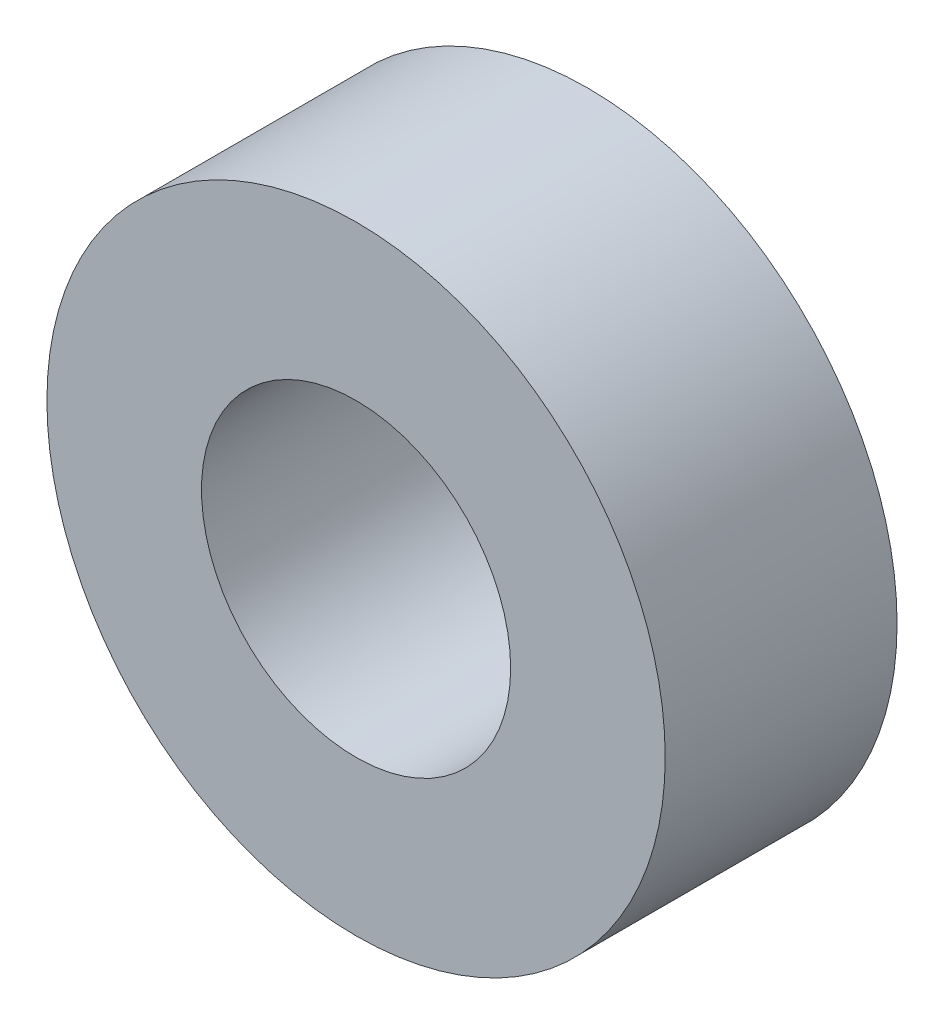
ISO-10303-21;
HEADER;
FILE_DESCRIPTION(('STEP AP214'),'2;1');
FILE_NAME('part.step','',(''),(''),'','','');
FILE_SCHEMA(('AUTOMOTIVE_DESIGN { 1 0 10303 214 1 1 1 1 }'));
ENDSEC;
DATA;
#1=APPLICATION_CONTEXT('core data for automotive mechanical design processes');
#2=APPLICATION_PROTOCOL_DEFINITION('international standard','automotive_design',2000,#1);
#3=PRODUCT_CONTEXT('',#1,'mechanical');
#4=PRODUCT('Part','Part','',(#3));
#5=PRODUCT_RELATED_PRODUCT_CATEGORY('part','',(#4));
#6=PRODUCT_DEFINITION_FORMATION('','',#4);
#7=PRODUCT_DEFINITION_CONTEXT('part definition',#1,'design');
#8=PRODUCT_DEFINITION('design','',#6,#7);
#9=PRODUCT_DEFINITION_SHAPE('','',#8);
#10=(LENGTH_UNIT() NAMED_UNIT(*) SI_UNIT(.MILLI.,.METRE.));
#11=(NAMED_UNIT(*) PLANE_ANGLE_UNIT() SI_UNIT($,.RADIAN.));
#12=(NAMED_UNIT(*) SI_UNIT($,.STERADIAN.) SOLID_ANGLE_UNIT());
#13=UNCERTAINTY_MEASURE_WITH_UNIT(LENGTH_MEASURE(1.E-05),#10,'distance_accuracy_value','');
#14=(GEOMETRIC_REPRESENTATION_CONTEXT(3) GLOBAL_UNCERTAINTY_ASSIGNED_CONTEXT((#13)) GLOBAL_UNIT_ASSIGNED_CONTEXT((#10,
#11,#12)) REPRESENTATION_CONTEXT('',''));
#15=CARTESIAN_POINT('',(0.,0.,0.));
#16=DIRECTION('',(0.,0.,1.));
#17=DIRECTION('',(1.,0.,0.));
#18=AXIS2_PLACEMENT_3D('',#15,#16,#17);
#19=CARTESIAN_POINT('',(0.,0.,4.5));
#20=DIRECTION('',(0.,0.,1.));
#21=DIRECTION('',(1.,0.,0.));
#22=AXIS2_PLACEMENT_3D('',#19,#20,#21);
#23=PLANE('',#22);
#24=CARTESIAN_POINT('',(0.,0.,4.5));
#25=DIRECTION('',(0.,0.,1.));
#26=DIRECTION('',(1.,0.,0.));
#27=AXIS2_PLACEMENT_3D('',#24,#25,#26);
#28=CIRCLE('',#27,6.);
#29=CARTESIAN_POINT('',(6.,0.,4.5));
#30=VERTEX_POINT('',#29);
#31=EDGE_CURVE('E10',#30,#30,#28,.T.);
#32=ORIENTED_EDGE('',*,*,#31,.T.);
#33=EDGE_LOOP('',(#32));
#34=FACE_BOUND('',#33,.T.);
#35=CARTESIAN_POINT('',(0.,0.,4.5));
#36=DIRECTION('',(0.,0.,1.));
#37=DIRECTION('',(1.,0.,0.));
#38=AXIS2_PLACEMENT_3D('',#35,#36,#37);
#39=CIRCLE('',#38,3.);
#40=CARTESIAN_POINT('',(3.,0.,4.5));
#41=VERTEX_POINT('',#40);
#42=EDGE_CURVE('E45',#41,#41,#39,.T.);
#43=ORIENTED_EDGE('',*,*,#42,.F.);
#44=EDGE_LOOP('',(#43));
#45=FACE_BOUND('',#44,.T.);
#46=ADVANCED_FACE('F34',(#34,#45),#23,.T.);
#47=CARTESIAN_POINT('',(0.,0.,0.));
#48=DIRECTION('',(0.,0.,1.));
#49=DIRECTION('',(1.,0.,0.));
#50=AXIS2_PLACEMENT_3D('',#47,#48,#49);
#51=PLANE('',#50);
#52=CARTESIAN_POINT('',(0.,0.,0.));
#53=DIRECTION('',(0.,0.,1.));
#54=DIRECTION('',(1.,0.,0.));
#55=AXIS2_PLACEMENT_3D('',#52,#53,#54);
#56=CIRCLE('',#55,6.);
#57=CARTESIAN_POINT('',(6.,0.,0.));
#58=VERTEX_POINT('',#57);
#59=EDGE_CURVE('E38',#58,#58,#56,.T.);
#60=ORIENTED_EDGE('',*,*,#59,.F.);
#61=EDGE_LOOP('',(#60));
#62=FACE_BOUND('',#61,.T.);
#63=CARTESIAN_POINT('',(0.,0.,0.));
#64=DIRECTION('',(0.,0.,1.));
#65=DIRECTION('',(1.,0.,0.));
#66=AXIS2_PLACEMENT_3D('',#63,#64,#65);
#67=CIRCLE('',#66,3.);
#68=CARTESIAN_POINT('',(3.,0.,0.));
#69=VERTEX_POINT('',#68);
#70=EDGE_CURVE('E47',#69,#69,#67,.T.);
#71=ORIENTED_EDGE('',*,*,#70,.T.);
#72=EDGE_LOOP('',(#71));
#73=FACE_BOUND('',#72,.T.);
#74=ADVANCED_FACE('F57',(#62,#73),#51,.F.);
#75=CARTESIAN_POINT('',(0.,0.,4.5));
#76=DIRECTION('',(0.,0.,-1.));
#77=DIRECTION('',(-1.,0.,0.));
#78=AXIS2_PLACEMENT_3D('',#75,#76,#77);
#79=CYLINDRICAL_SURFACE('',#78,6.);
#80=ORIENTED_EDGE('',*,*,#31,.F.);
#81=EDGE_LOOP('',(#80));
#82=FACE_BOUND('',#81,.T.);
#83=ORIENTED_EDGE('',*,*,#59,.T.);
#84=EDGE_LOOP('',(#83));
#85=FACE_BOUND('',#84,.T.);
#86=ADVANCED_FACE('F36',(#82,#85),#79,.T.);
#87=CARTESIAN_POINT('',(0.,0.,4.5));
#88=DIRECTION('',(0.,0.,-1.));
#89=DIRECTION('',(-1.,0.,0.));
#90=AXIS2_PLACEMENT_3D('',#87,#88,#89);
#91=CYLINDRICAL_SURFACE('',#90,3.);
#92=ORIENTED_EDGE('',*,*,#42,.T.);
#93=EDGE_LOOP('',(#92));
#94=FACE_BOUND('',#93,.T.);
#95=ORIENTED_EDGE('',*,*,#70,.F.);
#96=EDGE_LOOP('',(#95));
#97=FACE_BOUND('',#96,.T.);
#98=ADVANCED_FACE('F53',(#94,#97),#91,.F.);
#99=CLOSED_SHELL('',(#46,#74,#86,#98));
#100=MANIFOLD_SOLID_BREP('B2',#99);
#101=ADVANCED_BREP_SHAPE_REPRESENTATION('',(#18,#100),#14);
#102=SHAPE_DEFINITION_REPRESENTATION(#9,#101);
ENDSEC;
END-ISO-10303-21;
